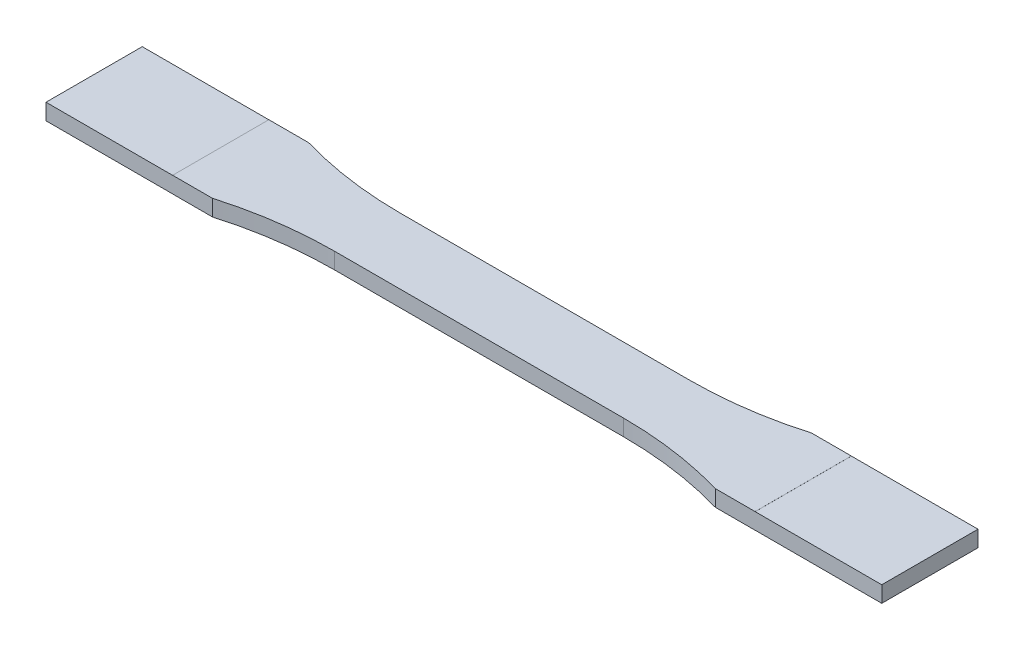
ISO-10303-21;
HEADER;
FILE_DESCRIPTION(('STEP AP214'),'2;1');
FILE_NAME('part.step','',(''),(''),'','','');
FILE_SCHEMA(('AUTOMOTIVE_DESIGN { 1 0 10303 214 1 1 1 1 }'));
ENDSEC;
DATA;
#1=APPLICATION_CONTEXT('core data for automotive mechanical design processes');
#2=APPLICATION_PROTOCOL_DEFINITION('international standard','automotive_design',2000,#1);
#3=PRODUCT_CONTEXT('',#1,'mechanical');
#4=PRODUCT('Part','Part','',(#3));
#5=PRODUCT_RELATED_PRODUCT_CATEGORY('part','',(#4));
#6=PRODUCT_DEFINITION_FORMATION('','',#4);
#7=PRODUCT_DEFINITION_CONTEXT('part definition',#1,'design');
#8=PRODUCT_DEFINITION('design','',#6,#7);
#9=PRODUCT_DEFINITION_SHAPE('','',#8);
#10=(LENGTH_UNIT() NAMED_UNIT(*) SI_UNIT(.MILLI.,.METRE.));
#11=(NAMED_UNIT(*) PLANE_ANGLE_UNIT() SI_UNIT($,.RADIAN.));
#12=(NAMED_UNIT(*) SI_UNIT($,.STERADIAN.) SOLID_ANGLE_UNIT());
#13=UNCERTAINTY_MEASURE_WITH_UNIT(LENGTH_MEASURE(1.E-05),#10,'distance_accuracy_value','');
#14=(GEOMETRIC_REPRESENTATION_CONTEXT(3) GLOBAL_UNCERTAINTY_ASSIGNED_CONTEXT((#13)) GLOBAL_UNIT_ASSIGNED_CONTEXT((#10,
#11,#12)) REPRESENTATION_CONTEXT('',''));
#15=CARTESIAN_POINT('',(0.,0.,0.));
#16=DIRECTION('',(0.,0.,1.));
#17=DIRECTION('',(1.,0.,0.));
#18=AXIS2_PLACEMENT_3D('',#15,#16,#17);
#19=CARTESIAN_POINT('',(82.5,1.6,0.));
#20=DIRECTION('',(-1.,0.,0.));
#21=DIRECTION('',(0.,0.,1.));
#22=AXIS2_PLACEMENT_3D('',#19,#20,#21);
#23=PLANE('',#22);
#24=DIRECTION('',(0.,0.,-1.));
#25=VECTOR('',#24,1.);
#26=CARTESIAN_POINT('',(82.5,-1.59,0.));
#27=LINE('',#26,#25);
#28=CARTESIAN_POINT('',(82.5,-1.59,9.49999999999999));
#29=VERTEX_POINT('',#28);
#30=CARTESIAN_POINT('',(82.5,-1.59,-9.50000000000001));
#31=VERTEX_POINT('',#30);
#32=EDGE_CURVE('E220',#29,#31,#27,.T.);
#33=ORIENTED_EDGE('',*,*,#32,.T.);
#34=DIRECTION('',(0.,-1.,0.));
#35=VECTOR('',#34,1.);
#36=CARTESIAN_POINT('',(82.5,1.6,-9.50000000000001));
#37=LINE('',#36,#35);
#38=CARTESIAN_POINT('',(82.5,1.59,-9.50000000000001));
#39=VERTEX_POINT('',#38);
#40=EDGE_CURVE('E382',#39,#31,#37,.T.);
#41=ORIENTED_EDGE('',*,*,#40,.F.);
#42=DIRECTION('',(0.,0.,-1.));
#43=VECTOR('',#42,1.);
#44=CARTESIAN_POINT('',(82.5,1.59,0.));
#45=LINE('',#44,#43);
#46=CARTESIAN_POINT('',(82.5,1.59,9.49999999999999));
#47=VERTEX_POINT('',#46);
#48=EDGE_CURVE('E276',#47,#39,#45,.T.);
#49=ORIENTED_EDGE('',*,*,#48,.F.);
#50=DIRECTION('',(0.,-1.,0.));
#51=VECTOR('',#50,1.);
#52=CARTESIAN_POINT('',(82.5,1.6,9.49999999999999));
#53=LINE('',#52,#51);
#54=EDGE_CURVE('E386',#47,#29,#53,.T.);
#55=ORIENTED_EDGE('',*,*,#54,.T.);
#56=EDGE_LOOP('',(#33,#41,#49,#55));
#57=FACE_BOUND('',#56,.T.);
#58=ADVANCED_FACE('F42',(#57),#23,.F.);
#59=CARTESIAN_POINT('',(-82.5,1.6,0.));
#60=DIRECTION('',(-1.,0.,0.));
#61=DIRECTION('',(0.,0.,1.));
#62=AXIS2_PLACEMENT_3D('',#59,#60,#61);
#63=PLANE('',#62);
#64=DIRECTION('',(0.,-1.,0.));
#65=VECTOR('',#64,1.);
#66=CARTESIAN_POINT('',(-82.5,1.6,-9.49999999999999));
#67=LINE('',#66,#65);
#68=CARTESIAN_POINT('',(-82.5,1.59,-9.49999999999999));
#69=VERTEX_POINT('',#68);
#70=CARTESIAN_POINT('',(-82.5,-1.59,-9.49999999999999));
#71=VERTEX_POINT('',#70);
#72=EDGE_CURVE('E365',#69,#71,#67,.T.);
#73=ORIENTED_EDGE('',*,*,#72,.T.);
#74=DIRECTION('',(0.,0.,1.));
#75=VECTOR('',#74,1.);
#76=CARTESIAN_POINT('',(-82.5,-1.59,0.));
#77=LINE('',#76,#75);
#78=CARTESIAN_POINT('',(-82.5,-1.59,9.50000000000001));
#79=VERTEX_POINT('',#78);
#80=EDGE_CURVE('E203',#71,#79,#77,.T.);
#81=ORIENTED_EDGE('',*,*,#80,.T.);
#82=DIRECTION('',(0.,-1.,0.));
#83=VECTOR('',#82,1.);
#84=CARTESIAN_POINT('',(-82.5,1.6,9.50000000000001));
#85=LINE('',#84,#83);
#86=CARTESIAN_POINT('',(-82.5,1.59,9.50000000000001));
#87=VERTEX_POINT('',#86);
#88=EDGE_CURVE('E201',#87,#79,#85,.T.);
#89=ORIENTED_EDGE('',*,*,#88,.F.);
#90=DIRECTION('',(0.,0.,1.));
#91=VECTOR('',#90,1.);
#92=CARTESIAN_POINT('',(-82.5,1.59,0.));
#93=LINE('',#92,#91);
#94=EDGE_CURVE('E246',#69,#87,#93,.T.);
#95=ORIENTED_EDGE('',*,*,#94,.F.);
#96=EDGE_LOOP('',(#73,#81,#89,#95));
#97=FACE_BOUND('',#96,.T.);
#98=ADVANCED_FACE('F432',(#97),#63,.T.);
#99=CARTESIAN_POINT('',(0.,1.6,9.5));
#100=DIRECTION('',(0.,0.,1.));
#101=DIRECTION('',(1.,0.,0.));
#102=AXIS2_PLACEMENT_3D('',#99,#100,#101);
#103=PLANE('',#102);
#104=DIRECTION('',(-1.,0.,0.));
#105=VECTOR('',#104,1.);
#106=CARTESIAN_POINT('',(0.,-1.6,9.5));
#107=LINE('',#106,#105);
#108=CARTESIAN_POINT('',(57.5,-1.6,9.49999999999999));
#109=VERTEX_POINT('',#108);
#110=CARTESIAN_POINT('',(49.642374511866,-1.6,9.49999999999999));
#111=VERTEX_POINT('',#110);
#112=EDGE_CURVE('E337',#109,#111,#107,.T.);
#113=ORIENTED_EDGE('',*,*,#112,.F.);
#114=DIRECTION('',(0.,-1.,0.));
#115=VECTOR('',#114,1.);
#116=CARTESIAN_POINT('',(57.5,-1.59,9.49999999999999));
#117=LINE('',#116,#115);
#118=CARTESIAN_POINT('',(57.5,-1.59,9.49999999999999));
#119=VERTEX_POINT('',#118);
#120=EDGE_CURVE('E58',#119,#109,#117,.T.);
#121=ORIENTED_EDGE('',*,*,#120,.F.);
#122=DIRECTION('',(1.,0.,0.));
#123=VECTOR('',#122,1.);
#124=CARTESIAN_POINT('',(0.,-1.59,9.5));
#125=LINE('',#124,#123);
#126=EDGE_CURVE('E225',#119,#29,#125,.T.);
#127=ORIENTED_EDGE('',*,*,#126,.T.);
#128=ORIENTED_EDGE('',*,*,#54,.F.);
#129=DIRECTION('',(1.,0.,0.));
#130=VECTOR('',#129,1.);
#131=CARTESIAN_POINT('',(0.,1.59,9.5));
#132=LINE('',#131,#130);
#133=CARTESIAN_POINT('',(57.5,1.59,9.49999999999999));
#134=VERTEX_POINT('',#133);
#135=EDGE_CURVE('E273',#134,#47,#132,.T.);
#136=ORIENTED_EDGE('',*,*,#135,.F.);
#137=DIRECTION('',(0.,1.,0.));
#138=VECTOR('',#137,1.);
#139=CARTESIAN_POINT('',(57.5,1.59,9.49999999999999));
#140=LINE('',#139,#138);
#141=CARTESIAN_POINT('',(57.5,1.6,9.49999999999999));
#142=VERTEX_POINT('',#141);
#143=EDGE_CURVE('E257',#134,#142,#140,.T.);
#144=ORIENTED_EDGE('',*,*,#143,.T.);
#145=DIRECTION('',(-1.,0.,0.));
#146=VECTOR('',#145,1.);
#147=CARTESIAN_POINT('',(0.,1.6,9.5));
#148=LINE('',#147,#146);
#149=CARTESIAN_POINT('',(49.642374511866,1.6,9.49999999999999));
#150=VERTEX_POINT('',#149);
#151=EDGE_CURVE('E300',#142,#150,#148,.T.);
#152=ORIENTED_EDGE('',*,*,#151,.T.);
#153=DIRECTION('',(0.,-1.,0.));
#154=VECTOR('',#153,1.);
#155=CARTESIAN_POINT('',(49.642374511866,1.6,9.49999999999999));
#156=LINE('',#155,#154);
#157=EDGE_CURVE('E390',#150,#111,#156,.T.);
#158=ORIENTED_EDGE('',*,*,#157,.T.);
#159=EDGE_LOOP('',(#113,#121,#127,#128,#136,#144,#152,#158));
#160=FACE_BOUND('',#159,.T.);
#161=ADVANCED_FACE('F409',(#160),#103,.T.);
#162=CARTESIAN_POINT('',(0.,1.6,-9.5));
#163=DIRECTION('',(0.,0.,1.));
#164=DIRECTION('',(1.,0.,0.));
#165=AXIS2_PLACEMENT_3D('',#162,#163,#164);
#166=PLANE('',#165);
#167=DIRECTION('',(0.,-1.,0.));
#168=VECTOR('',#167,1.);
#169=CARTESIAN_POINT('',(57.5,-1.59,-9.50000000000001));
#170=LINE('',#169,#168);
#171=CARTESIAN_POINT('',(57.5,-1.59,-9.50000000000001));
#172=VERTEX_POINT('',#171);
#173=CARTESIAN_POINT('',(57.5,-1.6,-9.50000000000001));
#174=VERTEX_POINT('',#173);
#175=EDGE_CURVE('E212',#172,#174,#170,.T.);
#176=ORIENTED_EDGE('',*,*,#175,.T.);
#177=DIRECTION('',(-1.,0.,0.));
#178=VECTOR('',#177,1.);
#179=CARTESIAN_POINT('',(0.,-1.6,-9.5));
#180=LINE('',#179,#178);
#181=CARTESIAN_POINT('',(49.6423745118659,-1.6,-9.5));
#182=VERTEX_POINT('',#181);
#183=EDGE_CURVE('E340',#174,#182,#180,.T.);
#184=ORIENTED_EDGE('',*,*,#183,.T.);
#185=DIRECTION('',(0.,-1.,0.));
#186=VECTOR('',#185,1.);
#187=CARTESIAN_POINT('',(49.6423745118659,1.6,-9.5));
#188=LINE('',#187,#186);
#189=CARTESIAN_POINT('',(49.6423745118659,1.6,-9.5));
#190=VERTEX_POINT('',#189);
#191=EDGE_CURVE('E378',#190,#182,#188,.T.);
#192=ORIENTED_EDGE('',*,*,#191,.F.);
#193=DIRECTION('',(-1.,0.,0.));
#194=VECTOR('',#193,1.);
#195=CARTESIAN_POINT('',(0.,1.6,-9.5));
#196=LINE('',#195,#194);
#197=CARTESIAN_POINT('',(57.5,1.6,-9.50000000000001));
#198=VERTEX_POINT('',#197);
#199=EDGE_CURVE('E303',#198,#190,#196,.T.);
#200=ORIENTED_EDGE('',*,*,#199,.F.);
#201=DIRECTION('',(0.,1.,0.));
#202=VECTOR('',#201,1.);
#203=CARTESIAN_POINT('',(57.5,1.59,-9.50000000000001));
#204=LINE('',#203,#202);
#205=CARTESIAN_POINT('',(57.5,1.59,-9.50000000000001));
#206=VERTEX_POINT('',#205);
#207=EDGE_CURVE('E279',#206,#198,#204,.T.);
#208=ORIENTED_EDGE('',*,*,#207,.F.);
#209=DIRECTION('',(-1.,0.,0.));
#210=VECTOR('',#209,1.);
#211=CARTESIAN_POINT('',(0.,1.59,-9.5));
#212=LINE('',#211,#210);
#213=EDGE_CURVE('E265',#39,#206,#212,.T.);
#214=ORIENTED_EDGE('',*,*,#213,.F.);
#215=ORIENTED_EDGE('',*,*,#40,.T.);
#216=DIRECTION('',(-1.,0.,0.));
#217=VECTOR('',#216,1.);
#218=CARTESIAN_POINT('',(0.,-1.59,-9.5));
#219=LINE('',#218,#217);
#220=EDGE_CURVE('E216',#31,#172,#219,.T.);
#221=ORIENTED_EDGE('',*,*,#220,.T.);
#222=EDGE_LOOP('',(#176,#184,#192,#200,#208,#214,#215,#221));
#223=FACE_BOUND('',#222,.T.);
#224=ADVANCED_FACE('F448',(#223),#166,.F.);
#225=CARTESIAN_POINT('',(0.,-1.6,0.));
#226=DIRECTION('',(0.,1.,0.));
#227=DIRECTION('',(0.,0.,1.));
#228=AXIS2_PLACEMENT_3D('',#225,#226,#227);
#229=PLANE('',#228);
#230=DIRECTION('',(-1.,0.,0.));
#231=VECTOR('',#230,1.);
#232=CARTESIAN_POINT('',(0.,-1.6,9.5));
#233=LINE('',#232,#231);
#234=CARTESIAN_POINT('',(-49.642374511866,-1.6,9.5));
#235=VERTEX_POINT('',#234);
#236=CARTESIAN_POINT('',(-57.5,-1.6,9.50000000000001));
#237=VERTEX_POINT('',#236);
#238=EDGE_CURVE('E292',#235,#237,#233,.T.);
#239=ORIENTED_EDGE('',*,*,#238,.T.);
#240=DIRECTION('',(0.,0.,1.));
#241=VECTOR('',#240,1.);
#242=CARTESIAN_POINT('',(-57.5,-1.6,0.));
#243=LINE('',#242,#241);
#244=CARTESIAN_POINT('',(-57.5,-1.6,-9.49999999999999));
#245=VERTEX_POINT('',#244);
#246=EDGE_CURVE('E182',#245,#237,#243,.T.);
#247=ORIENTED_EDGE('',*,*,#246,.F.);
#248=DIRECTION('',(-1.,0.,0.));
#249=VECTOR('',#248,1.);
#250=CARTESIAN_POINT('',(0.,-1.6,-9.5));
#251=LINE('',#250,#249);
#252=CARTESIAN_POINT('',(-49.642374511866,-1.6,-9.49999999999999));
#253=VERTEX_POINT('',#252);
#254=EDGE_CURVE('E355',#253,#245,#251,.T.);
#255=ORIENTED_EDGE('',*,*,#254,.F.);
#256=CARTESIAN_POINT('',(-28.5,-1.6,-82.5));
#257=DIRECTION('',(0.,1.,0.));
#258=DIRECTION('',(0.,0.,1.));
#259=AXIS2_PLACEMENT_3D('',#256,#257,#258);
#260=CIRCLE('',#259,76.);
#261=CARTESIAN_POINT('',(-28.5,-1.6,-6.5));
#262=VERTEX_POINT('',#261);
#263=EDGE_CURVE('E351',#253,#262,#260,.T.);
#264=ORIENTED_EDGE('',*,*,#263,.T.);
#265=DIRECTION('',(-1.,0.,0.));
#266=VECTOR('',#265,1.);
#267=CARTESIAN_POINT('',(0.,-1.6,-6.5));
#268=LINE('',#267,#266);
#269=CARTESIAN_POINT('',(28.5,-1.6,-6.50000000000001));
#270=VERTEX_POINT('',#269);
#271=EDGE_CURVE('E347',#270,#262,#268,.T.);
#272=ORIENTED_EDGE('',*,*,#271,.F.);
#273=CARTESIAN_POINT('',(28.5,-1.6,-82.5));
#274=DIRECTION('',(0.,1.,0.));
#275=DIRECTION('',(0.,0.,1.));
#276=AXIS2_PLACEMENT_3D('',#273,#274,#275);
#277=CIRCLE('',#276,76.);
#278=EDGE_CURVE('E343',#270,#182,#277,.T.);
#279=ORIENTED_EDGE('',*,*,#278,.T.);
#280=ORIENTED_EDGE('',*,*,#183,.F.);
#281=DIRECTION('',(0.,0.,1.));
#282=VECTOR('',#281,1.);
#283=CARTESIAN_POINT('',(57.5,-1.6,0.));
#284=LINE('',#283,#282);
#285=EDGE_CURVE('E221',#174,#109,#284,.T.);
#286=ORIENTED_EDGE('',*,*,#285,.T.);
#287=ORIENTED_EDGE('',*,*,#112,.T.);
#288=CARTESIAN_POINT('',(28.5,-1.6,82.5));
#289=DIRECTION('',(0.,1.,0.));
#290=DIRECTION('',(0.,0.,1.));
#291=AXIS2_PLACEMENT_3D('',#288,#289,#290);
#292=CIRCLE('',#291,76.);
#293=CARTESIAN_POINT('',(28.5,-1.6,6.5));
#294=VERTEX_POINT('',#293);
#295=EDGE_CURVE('E333',#111,#294,#292,.T.);
#296=ORIENTED_EDGE('',*,*,#295,.T.);
#297=DIRECTION('',(-1.,0.,0.));
#298=VECTOR('',#297,1.);
#299=CARTESIAN_POINT('',(0.,-1.6,6.5));
#300=LINE('',#299,#298);
#301=CARTESIAN_POINT('',(-28.5,-1.6,6.5));
#302=VERTEX_POINT('',#301);
#303=EDGE_CURVE('E329',#294,#302,#300,.T.);
#304=ORIENTED_EDGE('',*,*,#303,.T.);
#305=CARTESIAN_POINT('',(-28.5,-1.6,82.5));
#306=DIRECTION('',(0.,1.,0.));
#307=DIRECTION('',(0.,0.,1.));
#308=AXIS2_PLACEMENT_3D('',#305,#306,#307);
#309=CIRCLE('',#308,76.);
#310=EDGE_CURVE('E261',#302,#235,#309,.T.);
#311=ORIENTED_EDGE('',*,*,#310,.T.);
#312=EDGE_LOOP('',(#239,#247,#255,#264,#272,#279,#280,#286,#287,#296,#304,#311));
#313=FACE_BOUND('',#312,.T.);
#314=ADVANCED_FACE('F405',(#313),#229,.F.);
#315=CARTESIAN_POINT('',(0.,1.6,-9.5));
#316=DIRECTION('',(0.,0.,1.));
#317=DIRECTION('',(1.,0.,0.));
#318=AXIS2_PLACEMENT_3D('',#315,#316,#317);
#319=PLANE('',#318);
#320=ORIENTED_EDGE('',*,*,#254,.T.);
#321=DIRECTION('',(0.,-1.,0.));
#322=VECTOR('',#321,1.);
#323=CARTESIAN_POINT('',(-57.5,-1.59,-9.49999999999999));
#324=LINE('',#323,#322);
#325=CARTESIAN_POINT('',(-57.5,-1.59,-9.49999999999999));
#326=VERTEX_POINT('',#325);
#327=EDGE_CURVE('E66',#326,#245,#324,.T.);
#328=ORIENTED_EDGE('',*,*,#327,.F.);
#329=DIRECTION('',(-1.,0.,0.));
#330=VECTOR('',#329,1.);
#331=CARTESIAN_POINT('',(0.,-1.59,-9.5));
#332=LINE('',#331,#330);
#333=EDGE_CURVE('E188',#326,#71,#332,.T.);
#334=ORIENTED_EDGE('',*,*,#333,.T.);
#335=ORIENTED_EDGE('',*,*,#72,.F.);
#336=DIRECTION('',(-1.,0.,0.));
#337=VECTOR('',#336,1.);
#338=CARTESIAN_POINT('',(0.,1.59,-9.5));
#339=LINE('',#338,#337);
#340=CARTESIAN_POINT('',(-57.5,1.59,-9.49999999999999));
#341=VERTEX_POINT('',#340);
#342=EDGE_CURVE('E242',#341,#69,#339,.T.);
#343=ORIENTED_EDGE('',*,*,#342,.F.);
#344=DIRECTION('',(0.,1.,0.));
#345=VECTOR('',#344,1.);
#346=CARTESIAN_POINT('',(-57.5,1.59,-9.49999999999999));
#347=LINE('',#346,#345);
#348=CARTESIAN_POINT('',(-57.5,1.6,-9.49999999999999));
#349=VERTEX_POINT('',#348);
#350=EDGE_CURVE('E253',#341,#349,#347,.T.);
#351=ORIENTED_EDGE('',*,*,#350,.T.);
#352=DIRECTION('',(-1.,0.,0.));
#353=VECTOR('',#352,1.);
#354=CARTESIAN_POINT('',(0.,1.6,-9.5));
#355=LINE('',#354,#353);
#356=CARTESIAN_POINT('',(-49.642374511866,1.6,-9.49999999999999));
#357=VERTEX_POINT('',#356);
#358=EDGE_CURVE('E317',#357,#349,#355,.T.);
#359=ORIENTED_EDGE('',*,*,#358,.F.);
#360=DIRECTION('',(0.,-1.,0.));
#361=VECTOR('',#360,1.);
#362=CARTESIAN_POINT('',(-49.642374511866,1.6,-9.49999999999999));
#363=LINE('',#362,#361);
#364=EDGE_CURVE('E369',#357,#253,#363,.T.);
#365=ORIENTED_EDGE('',*,*,#364,.T.);
#366=EDGE_LOOP('',(#320,#328,#334,#335,#343,#351,#359,#365));
#367=FACE_BOUND('',#366,.T.);
#368=ADVANCED_FACE('F424',(#367),#319,.F.);
#369=CARTESIAN_POINT('',(0.,1.6,9.5));
#370=DIRECTION('',(0.,0.,1.));
#371=DIRECTION('',(1.,0.,0.));
#372=AXIS2_PLACEMENT_3D('',#369,#370,#371);
#373=PLANE('',#372);
#374=DIRECTION('',(0.,-1.,0.));
#375=VECTOR('',#374,1.);
#376=CARTESIAN_POINT('',(-57.5,-1.59,9.50000000000001));
#377=LINE('',#376,#375);
#378=CARTESIAN_POINT('',(-57.5,-1.59,9.50000000000001));
#379=VERTEX_POINT('',#378);
#380=EDGE_CURVE('E178',#379,#237,#377,.T.);
#381=ORIENTED_EDGE('',*,*,#380,.T.);
#382=ORIENTED_EDGE('',*,*,#238,.F.);
#383=DIRECTION('',(0.,-1.,0.));
#384=VECTOR('',#383,1.);
#385=CARTESIAN_POINT('',(-49.642374511866,1.6,9.5));
#386=LINE('',#385,#384);
#387=CARTESIAN_POINT('',(-49.642374511866,1.6,9.5));
#388=VERTEX_POINT('',#387);
#389=EDGE_CURVE('E325',#388,#235,#386,.T.);
#390=ORIENTED_EDGE('',*,*,#389,.F.);
#391=DIRECTION('',(-1.,0.,0.));
#392=VECTOR('',#391,1.);
#393=CARTESIAN_POINT('',(0.,1.6,9.5));
#394=LINE('',#393,#392);
#395=CARTESIAN_POINT('',(-57.5,1.6,9.50000000000001));
#396=VERTEX_POINT('',#395);
#397=EDGE_CURVE('E321',#388,#396,#394,.T.);
#398=ORIENTED_EDGE('',*,*,#397,.T.);
#399=DIRECTION('',(0.,1.,0.));
#400=VECTOR('',#399,1.);
#401=CARTESIAN_POINT('',(-57.5,1.59,9.50000000000001));
#402=LINE('',#401,#400);
#403=CARTESIAN_POINT('',(-57.5,1.59,9.50000000000001));
#404=VERTEX_POINT('',#403);
#405=EDGE_CURVE('E258',#404,#396,#402,.T.);
#406=ORIENTED_EDGE('',*,*,#405,.F.);
#407=DIRECTION('',(1.,0.,0.));
#408=VECTOR('',#407,1.);
#409=CARTESIAN_POINT('',(0.,1.59,9.5));
#410=LINE('',#409,#408);
#411=EDGE_CURVE('E249',#87,#404,#410,.T.);
#412=ORIENTED_EDGE('',*,*,#411,.F.);
#413=ORIENTED_EDGE('',*,*,#88,.T.);
#414=DIRECTION('',(1.,0.,0.));
#415=VECTOR('',#414,1.);
#416=CARTESIAN_POINT('',(0.,-1.59,9.5));
#417=LINE('',#416,#415);
#418=EDGE_CURVE('E192',#79,#379,#417,.T.);
#419=ORIENTED_EDGE('',*,*,#418,.T.);
#420=EDGE_LOOP('',(#381,#382,#390,#398,#406,#412,#413,#419));
#421=FACE_BOUND('',#420,.T.);
#422=ADVANCED_FACE('F198',(#421),#373,.T.);
#423=CARTESIAN_POINT('',(0.,1.6,0.));
#424=DIRECTION('',(0.,1.,0.));
#425=DIRECTION('',(0.,0.,1.));
#426=AXIS2_PLACEMENT_3D('',#423,#424,#425);
#427=PLANE('',#426);
#428=ORIENTED_EDGE('',*,*,#358,.T.);
#429=DIRECTION('',(0.,0.,1.));
#430=VECTOR('',#429,1.);
#431=CARTESIAN_POINT('',(-57.5,1.6,0.));
#432=LINE('',#431,#430);
#433=EDGE_CURVE('E243',#349,#396,#432,.T.);
#434=ORIENTED_EDGE('',*,*,#433,.T.);
#435=ORIENTED_EDGE('',*,*,#397,.F.);
#436=CARTESIAN_POINT('',(-28.5,1.6,82.5));
#437=DIRECTION('',(0.,1.,0.));
#438=DIRECTION('',(0.,0.,1.));
#439=AXIS2_PLACEMENT_3D('',#436,#437,#438);
#440=CIRCLE('',#439,76.);
#441=CARTESIAN_POINT('',(-28.5,1.6,6.5));
#442=VERTEX_POINT('',#441);
#443=EDGE_CURVE('E287',#442,#388,#440,.T.);
#444=ORIENTED_EDGE('',*,*,#443,.F.);
#445=DIRECTION('',(-1.,0.,0.));
#446=VECTOR('',#445,1.);
#447=CARTESIAN_POINT('',(0.,1.6,6.5));
#448=LINE('',#447,#446);
#449=CARTESIAN_POINT('',(28.5,1.6,6.5));
#450=VERTEX_POINT('',#449);
#451=EDGE_CURVE('E291',#450,#442,#448,.T.);
#452=ORIENTED_EDGE('',*,*,#451,.F.);
#453=CARTESIAN_POINT('',(28.5,1.6,82.5));
#454=DIRECTION('',(0.,1.,0.));
#455=DIRECTION('',(0.,0.,1.));
#456=AXIS2_PLACEMENT_3D('',#453,#454,#455);
#457=CIRCLE('',#456,76.);
#458=EDGE_CURVE('E296',#150,#450,#457,.T.);
#459=ORIENTED_EDGE('',*,*,#458,.F.);
#460=ORIENTED_EDGE('',*,*,#151,.F.);
#461=DIRECTION('',(0.,0.,1.));
#462=VECTOR('',#461,1.);
#463=CARTESIAN_POINT('',(57.5,1.6,0.));
#464=LINE('',#463,#462);
#465=EDGE_CURVE('E214',#198,#142,#464,.T.);
#466=ORIENTED_EDGE('',*,*,#465,.F.);
#467=ORIENTED_EDGE('',*,*,#199,.T.);
#468=CARTESIAN_POINT('',(28.5,1.6,-82.5));
#469=DIRECTION('',(0.,1.,0.));
#470=DIRECTION('',(0.,0.,1.));
#471=AXIS2_PLACEMENT_3D('',#468,#469,#470);
#472=CIRCLE('',#471,76.);
#473=CARTESIAN_POINT('',(28.5,1.6,-6.50000000000001));
#474=VERTEX_POINT('',#473);
#475=EDGE_CURVE('E306',#474,#190,#472,.T.);
#476=ORIENTED_EDGE('',*,*,#475,.F.);
#477=DIRECTION('',(-1.,0.,0.));
#478=VECTOR('',#477,1.);
#479=CARTESIAN_POINT('',(0.,1.6,-6.5));
#480=LINE('',#479,#478);
#481=CARTESIAN_POINT('',(-28.5,1.6,-6.5));
#482=VERTEX_POINT('',#481);
#483=EDGE_CURVE('E310',#474,#482,#480,.T.);
#484=ORIENTED_EDGE('',*,*,#483,.T.);
#485=CARTESIAN_POINT('',(-28.5,1.6,-82.5));
#486=DIRECTION('',(0.,1.,0.));
#487=DIRECTION('',(0.,0.,1.));
#488=AXIS2_PLACEMENT_3D('',#485,#486,#487);
#489=CIRCLE('',#488,76.);
#490=EDGE_CURVE('E313',#357,#482,#489,.T.);
#491=ORIENTED_EDGE('',*,*,#490,.F.);
#492=EDGE_LOOP('',(#428,#434,#435,#444,#452,#459,#460,#466,#467,#476,#484,#491));
#493=FACE_BOUND('',#492,.T.);
#494=ADVANCED_FACE('F412',(#493),#427,.T.);
#495=CARTESIAN_POINT('',(-28.5,1.6,82.5));
#496=DIRECTION('',(0.,-1.,0.));
#497=DIRECTION('',(0.,0.,-1.));
#498=AXIS2_PLACEMENT_3D('',#495,#496,#497);
#499=CYLINDRICAL_SURFACE('',#498,76.);
#500=ORIENTED_EDGE('',*,*,#310,.F.);
#501=DIRECTION('',(0.,-1.,0.));
#502=VECTOR('',#501,1.);
#503=CARTESIAN_POINT('',(-28.5,1.6,6.5));
#504=LINE('',#503,#502);
#505=EDGE_CURVE('E11',#442,#302,#504,.T.);
#506=ORIENTED_EDGE('',*,*,#505,.F.);
#507=ORIENTED_EDGE('',*,*,#443,.T.);
#508=ORIENTED_EDGE('',*,*,#389,.T.);
#509=EDGE_LOOP('',(#500,#506,#507,#508));
#510=FACE_BOUND('',#509,.T.);
#511=ADVANCED_FACE('F44',(#510),#499,.F.);
#512=CARTESIAN_POINT('',(0.,1.6,6.5));
#513=DIRECTION('',(0.,0.,1.));
#514=DIRECTION('',(1.,0.,0.));
#515=AXIS2_PLACEMENT_3D('',#512,#513,#514);
#516=PLANE('',#515);
#517=ORIENTED_EDGE('',*,*,#303,.F.);
#518=DIRECTION('',(0.,-1.,0.));
#519=VECTOR('',#518,1.);
#520=CARTESIAN_POINT('',(28.5,1.6,6.5));
#521=LINE('',#520,#519);
#522=EDGE_CURVE('E51',#450,#294,#521,.T.);
#523=ORIENTED_EDGE('',*,*,#522,.F.);
#524=ORIENTED_EDGE('',*,*,#451,.T.);
#525=ORIENTED_EDGE('',*,*,#505,.T.);
#526=EDGE_LOOP('',(#517,#523,#524,#525));
#527=FACE_BOUND('',#526,.T.);
#528=ADVANCED_FACE('F402',(#527),#516,.T.);
#529=CARTESIAN_POINT('',(28.5,1.6,82.5));
#530=DIRECTION('',(0.,-1.,0.));
#531=DIRECTION('',(0.,0.,-1.));
#532=AXIS2_PLACEMENT_3D('',#529,#530,#531);
#533=CYLINDRICAL_SURFACE('',#532,76.);
#534=ORIENTED_EDGE('',*,*,#295,.F.);
#535=ORIENTED_EDGE('',*,*,#157,.F.);
#536=ORIENTED_EDGE('',*,*,#458,.T.);
#537=ORIENTED_EDGE('',*,*,#522,.T.);
#538=EDGE_LOOP('',(#534,#535,#536,#537));
#539=FACE_BOUND('',#538,.T.);
#540=ADVANCED_FACE('F397',(#539),#533,.F.);
#541=CARTESIAN_POINT('',(28.5,1.6,-82.5));
#542=DIRECTION('',(0.,-1.,0.));
#543=DIRECTION('',(0.,0.,-1.));
#544=AXIS2_PLACEMENT_3D('',#541,#542,#543);
#545=CYLINDRICAL_SURFACE('',#544,76.);
#546=ORIENTED_EDGE('',*,*,#278,.F.);
#547=DIRECTION('',(0.,-1.,0.));
#548=VECTOR('',#547,1.);
#549=CARTESIAN_POINT('',(28.5,1.6,-6.50000000000001));
#550=LINE('',#549,#548);
#551=EDGE_CURVE('E375',#474,#270,#550,.T.);
#552=ORIENTED_EDGE('',*,*,#551,.F.);
#553=ORIENTED_EDGE('',*,*,#475,.T.);
#554=ORIENTED_EDGE('',*,*,#191,.T.);
#555=EDGE_LOOP('',(#546,#552,#553,#554));
#556=FACE_BOUND('',#555,.T.);
#557=ADVANCED_FACE('F443',(#556),#545,.F.);
#558=CARTESIAN_POINT('',(0.,1.6,-6.5));
#559=DIRECTION('',(0.,0.,1.));
#560=DIRECTION('',(1.,0.,0.));
#561=AXIS2_PLACEMENT_3D('',#558,#559,#560);
#562=PLANE('',#561);
#563=ORIENTED_EDGE('',*,*,#271,.T.);
#564=DIRECTION('',(0.,-1.,0.));
#565=VECTOR('',#564,1.);
#566=CARTESIAN_POINT('',(-28.5,1.6,-6.5));
#567=LINE('',#566,#565);
#568=EDGE_CURVE('E372',#482,#262,#567,.T.);
#569=ORIENTED_EDGE('',*,*,#568,.F.);
#570=ORIENTED_EDGE('',*,*,#483,.F.);
#571=ORIENTED_EDGE('',*,*,#551,.T.);
#572=EDGE_LOOP('',(#563,#569,#570,#571));
#573=FACE_BOUND('',#572,.T.);
#574=ADVANCED_FACE('F440',(#573),#562,.F.);
#575=CARTESIAN_POINT('',(-28.5,1.6,-82.5));
#576=DIRECTION('',(0.,-1.,0.));
#577=DIRECTION('',(0.,0.,-1.));
#578=AXIS2_PLACEMENT_3D('',#575,#576,#577);
#579=CYLINDRICAL_SURFACE('',#578,76.);
#580=ORIENTED_EDGE('',*,*,#263,.F.);
#581=ORIENTED_EDGE('',*,*,#364,.F.);
#582=ORIENTED_EDGE('',*,*,#490,.T.);
#583=ORIENTED_EDGE('',*,*,#568,.T.);
#584=EDGE_LOOP('',(#580,#581,#582,#583));
#585=FACE_BOUND('',#584,.T.);
#586=ADVANCED_FACE('F436',(#585),#579,.F.);
#587=CARTESIAN_POINT('',(57.5,1.59,0.));
#588=DIRECTION('',(-1.,0.,0.));
#589=DIRECTION('',(0.,0.,1.));
#590=AXIS2_PLACEMENT_3D('',#587,#588,#589);
#591=PLANE('',#590);
#592=ORIENTED_EDGE('',*,*,#465,.T.);
#593=ORIENTED_EDGE('',*,*,#143,.F.);
#594=DIRECTION('',(0.,0.,1.));
#595=VECTOR('',#594,1.);
#596=CARTESIAN_POINT('',(57.5,1.59,0.));
#597=LINE('',#596,#595);
#598=EDGE_CURVE('E269',#206,#134,#597,.T.);
#599=ORIENTED_EDGE('',*,*,#598,.F.);
#600=ORIENTED_EDGE('',*,*,#207,.T.);
#601=EDGE_LOOP('',(#592,#593,#599,#600));
#602=FACE_BOUND('',#601,.T.);
#603=ADVANCED_FACE('F464',(#602),#591,.F.);
#604=CARTESIAN_POINT('',(0.,1.59,0.));
#605=DIRECTION('',(0.,1.,0.));
#606=DIRECTION('',(0.,0.,1.));
#607=AXIS2_PLACEMENT_3D('',#604,#605,#606);
#608=PLANE('',#607);
#609=ORIENTED_EDGE('',*,*,#213,.T.);
#610=ORIENTED_EDGE('',*,*,#598,.T.);
#611=ORIENTED_EDGE('',*,*,#135,.T.);
#612=ORIENTED_EDGE('',*,*,#48,.T.);
#613=EDGE_LOOP('',(#609,#610,#611,#612));
#614=FACE_BOUND('',#613,.T.);
#615=ADVANCED_FACE('F462',(#614),#608,.T.);
#616=CARTESIAN_POINT('',(-57.5,1.59,0.));
#617=DIRECTION('',(-1.,0.,0.));
#618=DIRECTION('',(0.,0.,1.));
#619=AXIS2_PLACEMENT_3D('',#616,#617,#618);
#620=PLANE('',#619);
#621=ORIENTED_EDGE('',*,*,#433,.F.);
#622=ORIENTED_EDGE('',*,*,#350,.F.);
#623=DIRECTION('',(0.,0.,1.));
#624=VECTOR('',#623,1.);
#625=CARTESIAN_POINT('',(-57.5,1.59,0.));
#626=LINE('',#625,#624);
#627=EDGE_CURVE('E239',#341,#404,#626,.T.);
#628=ORIENTED_EDGE('',*,*,#627,.T.);
#629=ORIENTED_EDGE('',*,*,#405,.T.);
#630=EDGE_LOOP('',(#621,#622,#628,#629));
#631=FACE_BOUND('',#630,.T.);
#632=ADVANCED_FACE('F419',(#631),#620,.T.);
#633=CARTESIAN_POINT('',(0.,1.59,0.));
#634=DIRECTION('',(0.,1.,0.));
#635=DIRECTION('',(0.,0.,1.));
#636=AXIS2_PLACEMENT_3D('',#633,#634,#635);
#637=PLANE('',#636);
#638=ORIENTED_EDGE('',*,*,#627,.F.);
#639=ORIENTED_EDGE('',*,*,#342,.T.);
#640=ORIENTED_EDGE('',*,*,#94,.T.);
#641=ORIENTED_EDGE('',*,*,#411,.T.);
#642=EDGE_LOOP('',(#638,#639,#640,#641));
#643=FACE_BOUND('',#642,.T.);
#644=ADVANCED_FACE('F429',(#643),#637,.T.);
#645=CARTESIAN_POINT('',(57.5,-1.59,0.));
#646=DIRECTION('',(1.,0.,0.));
#647=DIRECTION('',(0.,0.,-1.));
#648=AXIS2_PLACEMENT_3D('',#645,#646,#647);
#649=PLANE('',#648);
#650=ORIENTED_EDGE('',*,*,#285,.F.);
#651=ORIENTED_EDGE('',*,*,#175,.F.);
#652=DIRECTION('',(0.,0.,1.));
#653=VECTOR('',#652,1.);
#654=CARTESIAN_POINT('',(57.5,-1.59,0.));
#655=LINE('',#654,#653);
#656=EDGE_CURVE('E229',#172,#119,#655,.T.);
#657=ORIENTED_EDGE('',*,*,#656,.T.);
#658=ORIENTED_EDGE('',*,*,#120,.T.);
#659=EDGE_LOOP('',(#650,#651,#657,#658));
#660=FACE_BOUND('',#659,.T.);
#661=ADVANCED_FACE('F451',(#660),#649,.T.);
#662=CARTESIAN_POINT('',(0.,-1.59,0.));
#663=DIRECTION('',(0.,-1.,0.));
#664=DIRECTION('',(0.,0.,1.));
#665=AXIS2_PLACEMENT_3D('',#662,#663,#664);
#666=PLANE('',#665);
#667=ORIENTED_EDGE('',*,*,#220,.F.);
#668=ORIENTED_EDGE('',*,*,#32,.F.);
#669=ORIENTED_EDGE('',*,*,#126,.F.);
#670=ORIENTED_EDGE('',*,*,#656,.F.);
#671=EDGE_LOOP('',(#667,#668,#669,#670));
#672=FACE_BOUND('',#671,.T.);
#673=ADVANCED_FACE('F454',(#672),#666,.T.);
#674=CARTESIAN_POINT('',(-57.5,-1.59,0.));
#675=DIRECTION('',(1.,0.,0.));
#676=DIRECTION('',(0.,0.,-1.));
#677=AXIS2_PLACEMENT_3D('',#674,#675,#676);
#678=PLANE('',#677);
#679=ORIENTED_EDGE('',*,*,#246,.T.);
#680=ORIENTED_EDGE('',*,*,#380,.F.);
#681=DIRECTION('',(0.,0.,1.));
#682=VECTOR('',#681,1.);
#683=CARTESIAN_POINT('',(-57.5,-1.59,0.));
#684=LINE('',#683,#682);
#685=EDGE_CURVE('E181',#326,#379,#684,.T.);
#686=ORIENTED_EDGE('',*,*,#685,.F.);
#687=ORIENTED_EDGE('',*,*,#327,.T.);
#688=EDGE_LOOP('',(#679,#680,#686,#687));
#689=FACE_BOUND('',#688,.T.);
#690=ADVANCED_FACE('F180',(#689),#678,.F.);
#691=CARTESIAN_POINT('',(0.,-1.59,0.));
#692=DIRECTION('',(0.,-1.,0.));
#693=DIRECTION('',(0.,0.,1.));
#694=AXIS2_PLACEMENT_3D('',#691,#692,#693);
#695=PLANE('',#694);
#696=ORIENTED_EDGE('',*,*,#685,.T.);
#697=ORIENTED_EDGE('',*,*,#418,.F.);
#698=ORIENTED_EDGE('',*,*,#80,.F.);
#699=ORIENTED_EDGE('',*,*,#333,.F.);
#700=EDGE_LOOP('',(#696,#697,#698,#699));
#701=FACE_BOUND('',#700,.T.);
#702=ADVANCED_FACE('F191',(#701),#695,.T.);
#703=CLOSED_SHELL('',(#58,#98,#161,#224,#314,#368,#422,#494,#511,#528,#540,#557,#574,#586,#603,
#615,#632,#644,#661,#673,#690,#702));
#704=MANIFOLD_SOLID_BREP('B2',#703);
#705=ADVANCED_BREP_SHAPE_REPRESENTATION('',(#18,#704),#14);
#706=SHAPE_DEFINITION_REPRESENTATION(#9,#705);
ENDSEC;
END-ISO-10303-21;
